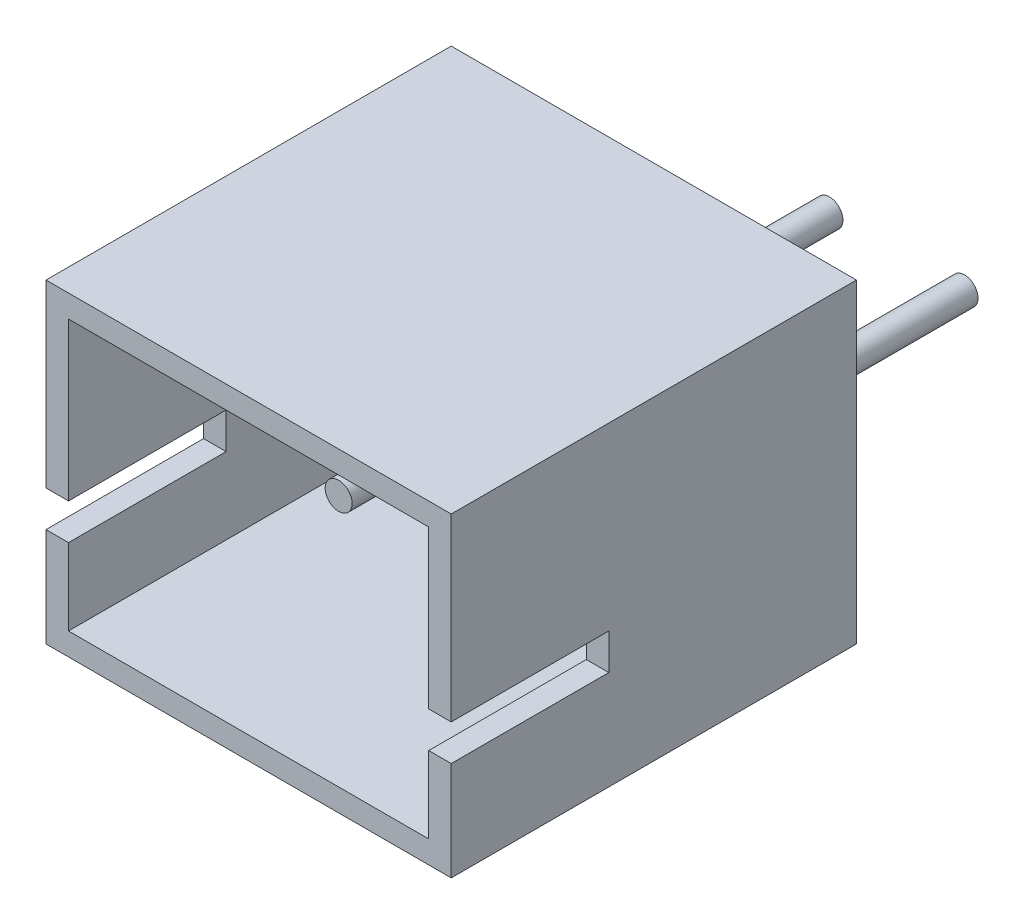
ISO-10303-21;
HEADER;
FILE_DESCRIPTION(('STEP AP214'),'2;1');
FILE_NAME('part.step','',(''),(''),'','','');
FILE_SCHEMA(('AUTOMOTIVE_DESIGN { 1 0 10303 214 1 1 1 1 }'));
ENDSEC;
DATA;
#1=APPLICATION_CONTEXT('core data for automotive mechanical design processes');
#2=APPLICATION_PROTOCOL_DEFINITION('international standard','automotive_design',2000,#1);
#3=PRODUCT_CONTEXT('',#1,'mechanical');
#4=PRODUCT('Part','Part','',(#3));
#5=PRODUCT_RELATED_PRODUCT_CATEGORY('part','',(#4));
#6=PRODUCT_DEFINITION_FORMATION('','',#4);
#7=PRODUCT_DEFINITION_CONTEXT('part definition',#1,'design');
#8=PRODUCT_DEFINITION('design','',#6,#7);
#9=PRODUCT_DEFINITION_SHAPE('','',#8);
#10=(LENGTH_UNIT() NAMED_UNIT(*) SI_UNIT(.MILLI.,.METRE.));
#11=(NAMED_UNIT(*) PLANE_ANGLE_UNIT() SI_UNIT($,.RADIAN.));
#12=(NAMED_UNIT(*) SI_UNIT($,.STERADIAN.) SOLID_ANGLE_UNIT());
#13=UNCERTAINTY_MEASURE_WITH_UNIT(LENGTH_MEASURE(1.E-05),#10,'distance_accuracy_value','');
#14=(GEOMETRIC_REPRESENTATION_CONTEXT(3) GLOBAL_UNCERTAINTY_ASSIGNED_CONTEXT((#13)) GLOBAL_UNIT_ASSIGNED_CONTEXT((#10,
#11,#12)) REPRESENTATION_CONTEXT('',''));
#15=CARTESIAN_POINT('',(0.,0.,0.));
#16=DIRECTION('',(0.,0.,1.));
#17=DIRECTION('',(1.,0.,0.));
#18=AXIS2_PLACEMENT_3D('',#15,#16,#17);
#19=CARTESIAN_POINT('',(0.,0.,4.5));
#20=DIRECTION('',(0.,0.,1.));
#21=DIRECTION('',(1.,0.,0.));
#22=AXIS2_PLACEMENT_3D('',#19,#20,#21);
#23=PLANE('',#22);
#24=DIRECTION('',(-1.,0.,0.));
#25=VECTOR('',#24,1.);
#26=CARTESIAN_POINT('',(0.,-0.25,4.5));
#27=LINE('',#26,#25);
#28=CARTESIAN_POINT('',(2.25,-0.249999999999999,4.5));
#29=VERTEX_POINT('',#28);
#30=CARTESIAN_POINT('',(2.,-0.249999999999999,4.5));
#31=VERTEX_POINT('',#30);
#32=EDGE_CURVE('E214',#29,#31,#27,.T.);
#33=ORIENTED_EDGE('',*,*,#32,.F.);
#34=DIRECTION('',(0.,1.,0.));
#35=VECTOR('',#34,1.);
#36=CARTESIAN_POINT('',(2.25,1.75,4.5));
#37=LINE('',#36,#35);
#38=CARTESIAN_POINT('',(2.25,1.75,4.5));
#39=VERTEX_POINT('',#38);
#40=EDGE_CURVE('E287',#29,#39,#37,.T.);
#41=ORIENTED_EDGE('',*,*,#40,.T.);
#42=DIRECTION('',(-1.,0.,0.));
#43=VECTOR('',#42,1.);
#44=CARTESIAN_POINT('',(-2.25,1.75,4.5));
#45=LINE('',#44,#43);
#46=CARTESIAN_POINT('',(-2.25,1.75,4.5));
#47=VERTEX_POINT('',#46);
#48=EDGE_CURVE('E286',#39,#47,#45,.T.);
#49=ORIENTED_EDGE('',*,*,#48,.T.);
#50=DIRECTION('',(0.,-1.,0.));
#51=VECTOR('',#50,1.);
#52=CARTESIAN_POINT('',(-2.25,1.75,4.5));
#53=LINE('',#52,#51);
#54=CARTESIAN_POINT('',(-2.25,-0.25,4.5));
#55=VERTEX_POINT('',#54);
#56=EDGE_CURVE('E291',#47,#55,#53,.T.);
#57=ORIENTED_EDGE('',*,*,#56,.T.);
#58=CARTESIAN_POINT('',(-2.,-0.25,4.5));
#59=VERTEX_POINT('',#58);
#60=EDGE_CURVE('E210',#59,#55,#27,.T.);
#61=ORIENTED_EDGE('',*,*,#60,.F.);
#62=DIRECTION('',(0.,-1.,0.));
#63=VECTOR('',#62,1.);
#64=CARTESIAN_POINT('',(-2.,1.5,4.5));
#65=LINE('',#64,#63);
#66=CARTESIAN_POINT('',(-2.,1.5,4.5));
#67=VERTEX_POINT('',#66);
#68=EDGE_CURVE('E262',#67,#59,#65,.T.);
#69=ORIENTED_EDGE('',*,*,#68,.F.);
#70=DIRECTION('',(-1.,0.,0.));
#71=VECTOR('',#70,1.);
#72=CARTESIAN_POINT('',(-2.,1.5,4.5));
#73=LINE('',#72,#71);
#74=CARTESIAN_POINT('',(2.,1.5,4.5));
#75=VERTEX_POINT('',#74);
#76=EDGE_CURVE('E257',#75,#67,#73,.T.);
#77=ORIENTED_EDGE('',*,*,#76,.F.);
#78=DIRECTION('',(0.,1.,0.));
#79=VECTOR('',#78,1.);
#80=CARTESIAN_POINT('',(2.,1.5,4.5));
#81=LINE('',#80,#79);
#82=EDGE_CURVE('E234',#31,#75,#81,.T.);
#83=ORIENTED_EDGE('',*,*,#82,.F.);
#84=EDGE_LOOP('',(#33,#41,#49,#57,#61,#69,#77,#83));
#85=FACE_BOUND('',#84,.T.);
#86=ADVANCED_FACE('F39',(#85),#23,.T.);
#87=CARTESIAN_POINT('',(2.25,1.75,4.5));
#88=DIRECTION('',(-1.,0.,0.));
#89=DIRECTION('',(0.,-1.,0.));
#90=AXIS2_PLACEMENT_3D('',#87,#88,#89);
#91=PLANE('',#90);
#92=ORIENTED_EDGE('',*,*,#40,.F.);
#93=DIRECTION('',(0.,0.,-1.));
#94=VECTOR('',#93,1.);
#95=CARTESIAN_POINT('',(2.25,-0.249999999999999,6.25));
#96=LINE('',#95,#94);
#97=CARTESIAN_POINT('',(2.25,-0.25,2.75));
#98=VERTEX_POINT('',#97);
#99=EDGE_CURVE('E173',#29,#98,#96,.T.);
#100=ORIENTED_EDGE('',*,*,#99,.T.);
#101=DIRECTION('',(0.,-1.,0.));
#102=VECTOR('',#101,1.);
#103=CARTESIAN_POINT('',(2.25,-0.25,2.75));
#104=LINE('',#103,#102);
#105=CARTESIAN_POINT('',(2.25,-0.65,2.75));
#106=VERTEX_POINT('',#105);
#107=EDGE_CURVE('E155',#98,#106,#104,.T.);
#108=ORIENTED_EDGE('',*,*,#107,.T.);
#109=DIRECTION('',(0.,0.,1.));
#110=VECTOR('',#109,1.);
#111=CARTESIAN_POINT('',(2.25,-0.649999999999999,6.25));
#112=LINE('',#111,#110);
#113=CARTESIAN_POINT('',(2.25,-0.649999999999999,4.5));
#114=VERTEX_POINT('',#113);
#115=EDGE_CURVE('E165',#106,#114,#112,.T.);
#116=ORIENTED_EDGE('',*,*,#115,.T.);
#117=CARTESIAN_POINT('',(2.25,-1.75,4.5));
#118=VERTEX_POINT('',#117);
#119=EDGE_CURVE('E283',#118,#114,#37,.T.);
#120=ORIENTED_EDGE('',*,*,#119,.F.);
#121=DIRECTION('',(0.,0.,-1.));
#122=VECTOR('',#121,1.);
#123=CARTESIAN_POINT('',(2.25,-1.75,4.5));
#124=LINE('',#123,#122);
#125=CARTESIAN_POINT('',(2.25,-1.75,0.));
#126=VERTEX_POINT('',#125);
#127=EDGE_CURVE('E298',#118,#126,#124,.T.);
#128=ORIENTED_EDGE('',*,*,#127,.T.);
#129=DIRECTION('',(0.,1.,0.));
#130=VECTOR('',#129,1.);
#131=CARTESIAN_POINT('',(2.25,1.75,0.));
#132=LINE('',#131,#130);
#133=CARTESIAN_POINT('',(2.25,1.75,0.));
#134=VERTEX_POINT('',#133);
#135=EDGE_CURVE('E272',#126,#134,#132,.T.);
#136=ORIENTED_EDGE('',*,*,#135,.T.);
#137=DIRECTION('',(0.,0.,-1.));
#138=VECTOR('',#137,1.);
#139=CARTESIAN_POINT('',(2.25,1.75,4.5));
#140=LINE('',#139,#138);
#141=EDGE_CURVE('E322',#39,#134,#140,.T.);
#142=ORIENTED_EDGE('',*,*,#141,.F.);
#143=EDGE_LOOP('',(#92,#100,#108,#116,#120,#128,#136,#142));
#144=FACE_BOUND('',#143,.T.);
#145=ADVANCED_FACE('F41',(#144),#91,.F.);
#146=CARTESIAN_POINT('',(-2.25,1.75,4.5));
#147=DIRECTION('',(0.,-1.,0.));
#148=DIRECTION('',(0.,0.,-1.));
#149=AXIS2_PLACEMENT_3D('',#146,#147,#148);
#150=PLANE('',#149);
#151=DIRECTION('',(-1.,0.,0.));
#152=VECTOR('',#151,1.);
#153=CARTESIAN_POINT('',(-2.25,1.75,0.));
#154=LINE('',#153,#152);
#155=CARTESIAN_POINT('',(-2.25,1.75,0.));
#156=VERTEX_POINT('',#155);
#157=EDGE_CURVE('E302',#134,#156,#154,.T.);
#158=ORIENTED_EDGE('',*,*,#157,.T.);
#159=DIRECTION('',(0.,0.,-1.));
#160=VECTOR('',#159,1.);
#161=CARTESIAN_POINT('',(-2.25,1.75,4.5));
#162=LINE('',#161,#160);
#163=EDGE_CURVE('E318',#47,#156,#162,.T.);
#164=ORIENTED_EDGE('',*,*,#163,.F.);
#165=ORIENTED_EDGE('',*,*,#48,.F.);
#166=ORIENTED_EDGE('',*,*,#141,.T.);
#167=EDGE_LOOP('',(#158,#164,#165,#166));
#168=FACE_BOUND('',#167,.T.);
#169=ADVANCED_FACE('F373',(#168),#150,.F.);
#170=CARTESIAN_POINT('',(-2.25,1.75,4.5));
#171=DIRECTION('',(1.,0.,0.));
#172=DIRECTION('',(0.,1.,0.));
#173=AXIS2_PLACEMENT_3D('',#170,#171,#172);
#174=PLANE('',#173);
#175=DIRECTION('',(0.,-1.,0.));
#176=VECTOR('',#175,1.);
#177=CARTESIAN_POINT('',(-2.25,-0.250000000000001,2.75));
#178=LINE('',#177,#176);
#179=CARTESIAN_POINT('',(-2.25,-0.250000000000001,2.75));
#180=VERTEX_POINT('',#179);
#181=CARTESIAN_POINT('',(-2.25,-0.650000000000001,2.75));
#182=VERTEX_POINT('',#181);
#183=EDGE_CURVE('E185',#180,#182,#178,.T.);
#184=ORIENTED_EDGE('',*,*,#183,.F.);
#185=DIRECTION('',(0.,0.,-1.));
#186=VECTOR('',#185,1.);
#187=CARTESIAN_POINT('',(-2.25,-0.25,6.25));
#188=LINE('',#187,#186);
#189=EDGE_CURVE('E177',#55,#180,#188,.T.);
#190=ORIENTED_EDGE('',*,*,#189,.F.);
#191=ORIENTED_EDGE('',*,*,#56,.F.);
#192=ORIENTED_EDGE('',*,*,#163,.T.);
#193=DIRECTION('',(0.,-1.,0.));
#194=VECTOR('',#193,1.);
#195=CARTESIAN_POINT('',(-2.25,1.75,0.));
#196=LINE('',#195,#194);
#197=CARTESIAN_POINT('',(-2.25,-1.75,0.));
#198=VERTEX_POINT('',#197);
#199=EDGE_CURVE('E305',#156,#198,#196,.T.);
#200=ORIENTED_EDGE('',*,*,#199,.T.);
#201=DIRECTION('',(0.,0.,-1.));
#202=VECTOR('',#201,1.);
#203=CARTESIAN_POINT('',(-2.25,-1.75,4.5));
#204=LINE('',#203,#202);
#205=CARTESIAN_POINT('',(-2.25,-1.75,4.5));
#206=VERTEX_POINT('',#205);
#207=EDGE_CURVE('E314',#206,#198,#204,.T.);
#208=ORIENTED_EDGE('',*,*,#207,.F.);
#209=CARTESIAN_POINT('',(-2.25,-0.65,4.5));
#210=VERTEX_POINT('',#209);
#211=EDGE_CURVE('E290',#210,#206,#53,.T.);
#212=ORIENTED_EDGE('',*,*,#211,.F.);
#213=DIRECTION('',(0.,0.,1.));
#214=VECTOR('',#213,1.);
#215=CARTESIAN_POINT('',(-2.25,-0.65,6.25));
#216=LINE('',#215,#214);
#217=EDGE_CURVE('E180',#182,#210,#216,.T.);
#218=ORIENTED_EDGE('',*,*,#217,.F.);
#219=EDGE_LOOP('',(#184,#190,#191,#192,#200,#208,#212,#218));
#220=FACE_BOUND('',#219,.T.);
#221=ADVANCED_FACE('F361',(#220),#174,.F.);
#222=CARTESIAN_POINT('',(-2.25,-1.75,4.5));
#223=DIRECTION('',(0.,1.,0.));
#224=DIRECTION('',(0.,0.,1.));
#225=AXIS2_PLACEMENT_3D('',#222,#223,#224);
#226=PLANE('',#225);
#227=DIRECTION('',(1.,0.,0.));
#228=VECTOR('',#227,1.);
#229=CARTESIAN_POINT('',(-2.25,-1.75,0.));
#230=LINE('',#229,#228);
#231=EDGE_CURVE('E308',#198,#126,#230,.T.);
#232=ORIENTED_EDGE('',*,*,#231,.T.);
#233=ORIENTED_EDGE('',*,*,#127,.F.);
#234=DIRECTION('',(1.,0.,0.));
#235=VECTOR('',#234,1.);
#236=CARTESIAN_POINT('',(-2.25,-1.75,4.5));
#237=LINE('',#236,#235);
#238=EDGE_CURVE('E295',#206,#118,#237,.T.);
#239=ORIENTED_EDGE('',*,*,#238,.F.);
#240=ORIENTED_EDGE('',*,*,#207,.T.);
#241=EDGE_LOOP('',(#232,#233,#239,#240));
#242=FACE_BOUND('',#241,.T.);
#243=ADVANCED_FACE('F413',(#242),#226,.F.);
#244=DIRECTION('',(1.,0.,0.));
#245=VECTOR('',#244,1.);
#246=CARTESIAN_POINT('',(0.,-0.65,4.5));
#247=LINE('',#246,#245);
#248=CARTESIAN_POINT('',(-2.,-0.65,4.5));
#249=VERTEX_POINT('',#248);
#250=EDGE_CURVE('E63',#210,#249,#247,.T.);
#251=ORIENTED_EDGE('',*,*,#250,.F.);
#252=ORIENTED_EDGE('',*,*,#211,.T.);
#253=ORIENTED_EDGE('',*,*,#238,.T.);
#254=ORIENTED_EDGE('',*,*,#119,.T.);
#255=CARTESIAN_POINT('',(2.,-0.649999999999999,4.5));
#256=VERTEX_POINT('',#255);
#257=EDGE_CURVE('E168',#256,#114,#247,.T.);
#258=ORIENTED_EDGE('',*,*,#257,.F.);
#259=CARTESIAN_POINT('',(2.,-1.5,4.5));
#260=VERTEX_POINT('',#259);
#261=EDGE_CURVE('E253',#260,#256,#81,.T.);
#262=ORIENTED_EDGE('',*,*,#261,.F.);
#263=DIRECTION('',(1.,0.,0.));
#264=VECTOR('',#263,1.);
#265=CARTESIAN_POINT('',(-2.,-1.5,4.5));
#266=LINE('',#265,#264);
#267=CARTESIAN_POINT('',(-2.,-1.5,4.5));
#268=VERTEX_POINT('',#267);
#269=EDGE_CURVE('E240',#268,#260,#266,.T.);
#270=ORIENTED_EDGE('',*,*,#269,.F.);
#271=EDGE_CURVE('E261',#249,#268,#65,.T.);
#272=ORIENTED_EDGE('',*,*,#271,.F.);
#273=EDGE_LOOP('',(#251,#252,#253,#254,#258,#262,#270,#272));
#274=FACE_BOUND('',#273,.T.);
#275=ADVANCED_FACE('F343',(#274),#23,.T.);
#276=CARTESIAN_POINT('',(0.,0.,0.));
#277=DIRECTION('',(0.,0.,1.));
#278=DIRECTION('',(1.,0.,0.));
#279=AXIS2_PLACEMENT_3D('',#276,#277,#278);
#280=PLANE('',#279);
#281=CARTESIAN_POINT('',(-0.75,-0.45,0.));
#282=DIRECTION('',(0.,0.,1.));
#283=DIRECTION('',(1.,0.,0.));
#284=AXIS2_PLACEMENT_3D('',#281,#282,#283);
#285=CIRCLE('',#284,0.15);
#286=CARTESIAN_POINT('',(-0.6,-0.45,0.));
#287=VERTEX_POINT('',#286);
#288=EDGE_CURVE('E222',#287,#287,#285,.T.);
#289=ORIENTED_EDGE('',*,*,#288,.T.);
#290=EDGE_LOOP('',(#289));
#291=FACE_BOUND('',#290,.T.);
#292=CARTESIAN_POINT('',(0.75,-0.45,0.));
#293=DIRECTION('',(0.,0.,1.));
#294=DIRECTION('',(1.,0.,0.));
#295=AXIS2_PLACEMENT_3D('',#292,#293,#294);
#296=CIRCLE('',#295,0.15);
#297=CARTESIAN_POINT('',(0.9,-0.45,0.));
#298=VERTEX_POINT('',#297);
#299=EDGE_CURVE('E230',#298,#298,#296,.T.);
#300=ORIENTED_EDGE('',*,*,#299,.T.);
#301=EDGE_LOOP('',(#300));
#302=FACE_BOUND('',#301,.T.);
#303=ORIENTED_EDGE('',*,*,#135,.F.);
#304=ORIENTED_EDGE('',*,*,#231,.F.);
#305=ORIENTED_EDGE('',*,*,#199,.F.);
#306=ORIENTED_EDGE('',*,*,#157,.F.);
#307=EDGE_LOOP('',(#303,#304,#305,#306));
#308=FACE_BOUND('',#307,.T.);
#309=ADVANCED_FACE('F379',(#291,#302,#308),#280,.F.);
#310=CARTESIAN_POINT('',(2.,1.5,0.249999999999999));
#311=DIRECTION('',(1.,0.,0.));
#312=DIRECTION('',(0.,1.,0.));
#313=AXIS2_PLACEMENT_3D('',#310,#311,#312);
#314=PLANE('',#313);
#315=DIRECTION('',(0.,1.,0.));
#316=VECTOR('',#315,1.);
#317=CARTESIAN_POINT('',(2.,1.5,2.75));
#318=LINE('',#317,#316);
#319=CARTESIAN_POINT('',(2.,-0.65,2.75));
#320=VERTEX_POINT('',#319);
#321=CARTESIAN_POINT('',(2.,-0.25,2.75));
#322=VERTEX_POINT('',#321);
#323=EDGE_CURVE('E158',#320,#322,#318,.T.);
#324=ORIENTED_EDGE('',*,*,#323,.T.);
#325=DIRECTION('',(0.,0.,1.));
#326=VECTOR('',#325,1.);
#327=CARTESIAN_POINT('',(2.,-0.25,0.25));
#328=LINE('',#327,#326);
#329=EDGE_CURVE('E213',#322,#31,#328,.T.);
#330=ORIENTED_EDGE('',*,*,#329,.T.);
#331=ORIENTED_EDGE('',*,*,#82,.T.);
#332=DIRECTION('',(0.,0.,1.));
#333=VECTOR('',#332,1.);
#334=CARTESIAN_POINT('',(2.,1.5,0.249999999999999));
#335=LINE('',#334,#333);
#336=CARTESIAN_POINT('',(2.,1.5,0.249999999999999));
#337=VERTEX_POINT('',#336);
#338=EDGE_CURVE('E252',#337,#75,#335,.T.);
#339=ORIENTED_EDGE('',*,*,#338,.F.);
#340=DIRECTION('',(0.,1.,0.));
#341=VECTOR('',#340,1.);
#342=CARTESIAN_POINT('',(2.,1.5,0.249999999999999));
#343=LINE('',#342,#341);
#344=CARTESIAN_POINT('',(2.,-1.5,0.249999999999999));
#345=VERTEX_POINT('',#344);
#346=EDGE_CURVE('E235',#345,#337,#343,.T.);
#347=ORIENTED_EDGE('',*,*,#346,.F.);
#348=DIRECTION('',(0.,0.,1.));
#349=VECTOR('',#348,1.);
#350=CARTESIAN_POINT('',(2.,-1.5,0.249999999999999));
#351=LINE('',#350,#349);
#352=EDGE_CURVE('E269',#345,#260,#351,.T.);
#353=ORIENTED_EDGE('',*,*,#352,.T.);
#354=ORIENTED_EDGE('',*,*,#261,.T.);
#355=DIRECTION('',(0.,0.,-1.));
#356=VECTOR('',#355,1.);
#357=CARTESIAN_POINT('',(2.,-0.65,0.25));
#358=LINE('',#357,#356);
#359=EDGE_CURVE('E207',#256,#320,#358,.T.);
#360=ORIENTED_EDGE('',*,*,#359,.T.);
#361=EDGE_LOOP('',(#324,#330,#331,#339,#347,#353,#354,#360));
#362=FACE_BOUND('',#361,.T.);
#363=ADVANCED_FACE('F390',(#362),#314,.F.);
#364=CARTESIAN_POINT('',(-2.,-1.5,0.249999999999999));
#365=DIRECTION('',(0.,-1.,0.));
#366=DIRECTION('',(0.,0.,-1.));
#367=AXIS2_PLACEMENT_3D('',#364,#365,#366);
#368=PLANE('',#367);
#369=ORIENTED_EDGE('',*,*,#269,.T.);
#370=ORIENTED_EDGE('',*,*,#352,.F.);
#371=DIRECTION('',(1.,0.,0.));
#372=VECTOR('',#371,1.);
#373=CARTESIAN_POINT('',(-2.,-1.5,0.249999999999999));
#374=LINE('',#373,#372);
#375=CARTESIAN_POINT('',(-2.,-1.5,0.249999999999999));
#376=VERTEX_POINT('',#375);
#377=EDGE_CURVE('E248',#376,#345,#374,.T.);
#378=ORIENTED_EDGE('',*,*,#377,.F.);
#379=DIRECTION('',(0.,0.,1.));
#380=VECTOR('',#379,1.);
#381=CARTESIAN_POINT('',(-2.,-1.5,0.249999999999999));
#382=LINE('',#381,#380);
#383=EDGE_CURVE('E273',#376,#268,#382,.T.);
#384=ORIENTED_EDGE('',*,*,#383,.T.);
#385=EDGE_LOOP('',(#369,#370,#378,#384));
#386=FACE_BOUND('',#385,.T.);
#387=ADVANCED_FACE('F451',(#386),#368,.F.);
#388=CARTESIAN_POINT('',(-2.,1.5,0.249999999999999));
#389=DIRECTION('',(-1.,0.,0.));
#390=DIRECTION('',(0.,0.,1.));
#391=AXIS2_PLACEMENT_3D('',#388,#389,#390);
#392=PLANE('',#391);
#393=ORIENTED_EDGE('',*,*,#68,.T.);
#394=DIRECTION('',(0.,0.,-1.));
#395=VECTOR('',#394,1.);
#396=CARTESIAN_POINT('',(-2.,-0.250000000000001,0.25));
#397=LINE('',#396,#395);
#398=CARTESIAN_POINT('',(-2.,-0.250000000000001,2.75));
#399=VERTEX_POINT('',#398);
#400=EDGE_CURVE('E11',#59,#399,#397,.T.);
#401=ORIENTED_EDGE('',*,*,#400,.T.);
#402=DIRECTION('',(0.,-1.,0.));
#403=VECTOR('',#402,1.);
#404=CARTESIAN_POINT('',(-2.,1.5,2.75));
#405=LINE('',#404,#403);
#406=CARTESIAN_POINT('',(-2.,-0.650000000000001,2.75));
#407=VERTEX_POINT('',#406);
#408=EDGE_CURVE('E199',#399,#407,#405,.T.);
#409=ORIENTED_EDGE('',*,*,#408,.T.);
#410=DIRECTION('',(0.,0.,1.));
#411=VECTOR('',#410,1.);
#412=CARTESIAN_POINT('',(-2.,-0.650000000000001,0.25));
#413=LINE('',#412,#411);
#414=EDGE_CURVE('E48',#407,#249,#413,.T.);
#415=ORIENTED_EDGE('',*,*,#414,.T.);
#416=ORIENTED_EDGE('',*,*,#271,.T.);
#417=ORIENTED_EDGE('',*,*,#383,.F.);
#418=DIRECTION('',(0.,-1.,0.));
#419=VECTOR('',#418,1.);
#420=CARTESIAN_POINT('',(-2.,1.5,0.249999999999999));
#421=LINE('',#420,#419);
#422=CARTESIAN_POINT('',(-2.,1.5,0.249999999999999));
#423=VERTEX_POINT('',#422);
#424=EDGE_CURVE('E244',#423,#376,#421,.T.);
#425=ORIENTED_EDGE('',*,*,#424,.F.);
#426=DIRECTION('',(0.,0.,1.));
#427=VECTOR('',#426,1.);
#428=CARTESIAN_POINT('',(-2.,1.5,0.249999999999999));
#429=LINE('',#428,#427);
#430=EDGE_CURVE('E277',#423,#67,#429,.T.);
#431=ORIENTED_EDGE('',*,*,#430,.T.);
#432=EDGE_LOOP('',(#393,#401,#409,#415,#416,#417,#425,#431));
#433=FACE_BOUND('',#432,.T.);
#434=ADVANCED_FACE('F339',(#433),#392,.F.);
#435=CARTESIAN_POINT('',(-2.,1.5,0.249999999999999));
#436=DIRECTION('',(0.,1.,0.));
#437=DIRECTION('',(0.,0.,1.));
#438=AXIS2_PLACEMENT_3D('',#435,#436,#437);
#439=PLANE('',#438);
#440=ORIENTED_EDGE('',*,*,#76,.T.);
#441=ORIENTED_EDGE('',*,*,#430,.F.);
#442=DIRECTION('',(-1.,0.,0.));
#443=VECTOR('',#442,1.);
#444=CARTESIAN_POINT('',(-2.,1.5,0.249999999999999));
#445=LINE('',#444,#443);
#446=EDGE_CURVE('E239',#337,#423,#445,.T.);
#447=ORIENTED_EDGE('',*,*,#446,.F.);
#448=ORIENTED_EDGE('',*,*,#338,.T.);
#449=EDGE_LOOP('',(#440,#441,#447,#448));
#450=FACE_BOUND('',#449,.T.);
#451=ADVANCED_FACE('F388',(#450),#439,.F.);
#452=CARTESIAN_POINT('',(0.,0.,0.249999999999999));
#453=DIRECTION('',(0.,0.,1.));
#454=DIRECTION('',(1.,0.,0.));
#455=AXIS2_PLACEMENT_3D('',#452,#453,#454);
#456=PLANE('',#455);
#457=CARTESIAN_POINT('',(-0.75,-0.45,0.249999999999999));
#458=DIRECTION('',(0.,0.,1.));
#459=DIRECTION('',(1.,0.,0.));
#460=AXIS2_PLACEMENT_3D('',#457,#458,#459);
#461=CIRCLE('',#460,0.15);
#462=CARTESIAN_POINT('',(-0.6,-0.45,0.249999999999999));
#463=VERTEX_POINT('',#462);
#464=EDGE_CURVE('E330',#463,#463,#461,.T.);
#465=ORIENTED_EDGE('',*,*,#464,.F.);
#466=EDGE_LOOP('',(#465));
#467=FACE_BOUND('',#466,.T.);
#468=CARTESIAN_POINT('',(0.75,-0.45,0.249999999999999));
#469=DIRECTION('',(0.,0.,1.));
#470=DIRECTION('',(1.,0.,0.));
#471=AXIS2_PLACEMENT_3D('',#468,#469,#470);
#472=CIRCLE('',#471,0.15);
#473=CARTESIAN_POINT('',(0.9,-0.45,0.249999999999999));
#474=VERTEX_POINT('',#473);
#475=EDGE_CURVE('E326',#474,#474,#472,.T.);
#476=ORIENTED_EDGE('',*,*,#475,.F.);
#477=EDGE_LOOP('',(#476));
#478=FACE_BOUND('',#477,.T.);
#479=ORIENTED_EDGE('',*,*,#346,.T.);
#480=ORIENTED_EDGE('',*,*,#446,.T.);
#481=ORIENTED_EDGE('',*,*,#424,.T.);
#482=ORIENTED_EDGE('',*,*,#377,.T.);
#483=EDGE_LOOP('',(#479,#480,#481,#482));
#484=FACE_BOUND('',#483,.T.);
#485=ADVANCED_FACE('F473',(#467,#478,#484),#456,.T.);
#486=CARTESIAN_POINT('',(0.75,-0.45,4.));
#487=DIRECTION('',(0.,0.,-1.));
#488=DIRECTION('',(-1.,0.,0.));
#489=AXIS2_PLACEMENT_3D('',#486,#487,#488);
#490=CYLINDRICAL_SURFACE('',#489,0.15);
#491=CARTESIAN_POINT('',(0.75,-0.45,2.75));
#492=DIRECTION('',(0.,0.,-1.));
#493=DIRECTION('',(-1.,0.,0.));
#494=AXIS2_PLACEMENT_3D('',#491,#492,#493);
#495=CIRCLE('',#494,0.15);
#496=CARTESIAN_POINT('',(0.6,-0.45,2.75));
#497=VERTEX_POINT('',#496);
#498=EDGE_CURVE('E195',#497,#497,#495,.F.);
#499=ORIENTED_EDGE('',*,*,#498,.F.);
#500=EDGE_LOOP('',(#499));
#501=FACE_BOUND('',#500,.T.);
#502=ORIENTED_EDGE('',*,*,#475,.T.);
#503=EDGE_LOOP('',(#502));
#504=FACE_BOUND('',#503,.T.);
#505=ADVANCED_FACE('F467',(#501,#504),#490,.T.);
#506=CARTESIAN_POINT('',(0.75,-0.45,-2.7));
#507=DIRECTION('',(0.,0.,-1.));
#508=DIRECTION('',(-1.,0.,0.));
#509=AXIS2_PLACEMENT_3D('',#506,#507,#508);
#510=CIRCLE('',#509,0.15);
#511=CARTESIAN_POINT('',(0.6,-0.45,-2.7));
#512=VERTEX_POINT('',#511);
#513=EDGE_CURVE('E226',#512,#512,#510,.T.);
#514=ORIENTED_EDGE('',*,*,#513,.F.);
#515=EDGE_LOOP('',(#514));
#516=FACE_BOUND('',#515,.T.);
#517=ORIENTED_EDGE('',*,*,#299,.F.);
#518=EDGE_LOOP('',(#517));
#519=FACE_BOUND('',#518,.T.);
#520=ADVANCED_FACE('F472',(#516,#519),#490,.T.);
#521=CARTESIAN_POINT('',(0.75,-0.45,-2.7));
#522=DIRECTION('',(0.,0.,-1.));
#523=DIRECTION('',(-1.,0.,0.));
#524=AXIS2_PLACEMENT_3D('',#521,#522,#523);
#525=PLANE('',#524);
#526=ORIENTED_EDGE('',*,*,#513,.T.);
#527=EDGE_LOOP('',(#526));
#528=FACE_BOUND('',#527,.T.);
#529=ADVANCED_FACE('F489',(#528),#525,.T.);
#530=CARTESIAN_POINT('',(-0.75,-0.45,4.));
#531=DIRECTION('',(0.,0.,-1.));
#532=DIRECTION('',(-1.,0.,0.));
#533=AXIS2_PLACEMENT_3D('',#530,#531,#532);
#534=CYLINDRICAL_SURFACE('',#533,0.15);
#535=CARTESIAN_POINT('',(-0.75,-0.45,2.75));
#536=DIRECTION('',(0.,0.,-1.));
#537=DIRECTION('',(-1.,0.,0.));
#538=AXIS2_PLACEMENT_3D('',#535,#536,#537);
#539=CIRCLE('',#538,0.15);
#540=CARTESIAN_POINT('',(-0.9,-0.45,2.75));
#541=VERTEX_POINT('',#540);
#542=EDGE_CURVE('E193',#541,#541,#539,.F.);
#543=ORIENTED_EDGE('',*,*,#542,.F.);
#544=EDGE_LOOP('',(#543));
#545=FACE_BOUND('',#544,.T.);
#546=ORIENTED_EDGE('',*,*,#464,.T.);
#547=EDGE_LOOP('',(#546));
#548=FACE_BOUND('',#547,.T.);
#549=ADVANCED_FACE('F483',(#545,#548),#534,.T.);
#550=CARTESIAN_POINT('',(-0.75,-0.45,-2.7));
#551=DIRECTION('',(0.,0.,-1.));
#552=DIRECTION('',(1.,0.,0.));
#553=AXIS2_PLACEMENT_3D('',#550,#551,#552);
#554=CIRCLE('',#553,0.15);
#555=CARTESIAN_POINT('',(-0.6,-0.45,-2.7));
#556=VERTEX_POINT('',#555);
#557=EDGE_CURVE('E218',#556,#556,#554,.T.);
#558=ORIENTED_EDGE('',*,*,#557,.F.);
#559=EDGE_LOOP('',(#558));
#560=FACE_BOUND('',#559,.T.);
#561=ORIENTED_EDGE('',*,*,#288,.F.);
#562=EDGE_LOOP('',(#561));
#563=FACE_BOUND('',#562,.T.);
#564=ADVANCED_FACE('F488',(#560,#563),#534,.T.);
#565=CARTESIAN_POINT('',(-0.75,-0.45,-2.7));
#566=DIRECTION('',(0.,0.,1.));
#567=DIRECTION('',(1.,0.,0.));
#568=AXIS2_PLACEMENT_3D('',#565,#566,#567);
#569=PLANE('',#568);
#570=ORIENTED_EDGE('',*,*,#557,.T.);
#571=EDGE_LOOP('',(#570));
#572=FACE_BOUND('',#571,.T.);
#573=ADVANCED_FACE('F504',(#572),#569,.F.);
#574=CARTESIAN_POINT('',(2.25,-0.25,2.75));
#575=DIRECTION('',(0.,0.,-1.));
#576=DIRECTION('',(-1.,0.,0.));
#577=AXIS2_PLACEMENT_3D('',#574,#575,#576);
#578=PLANE('',#577);
#579=ORIENTED_EDGE('',*,*,#542,.T.);
#580=EDGE_LOOP('',(#579));
#581=FACE_BOUND('',#580,.T.);
#582=ADVANCED_FACE('F499',(#581),#578,.F.);
#583=ORIENTED_EDGE('',*,*,#498,.T.);
#584=EDGE_LOOP('',(#583));
#585=FACE_BOUND('',#584,.T.);
#586=ADVANCED_FACE('F403',(#585),#578,.F.);
#587=CARTESIAN_POINT('',(2.25,-0.649999999999999,6.25));
#588=DIRECTION('',(0.,-1.,0.));
#589=DIRECTION('',(1.,0.,0.));
#590=AXIS2_PLACEMENT_3D('',#587,#588,#589);
#591=PLANE('',#590);
#592=ORIENTED_EDGE('',*,*,#250,.T.);
#593=ORIENTED_EDGE('',*,*,#414,.F.);
#594=DIRECTION('',(-1.,0.,0.));
#595=VECTOR('',#594,1.);
#596=CARTESIAN_POINT('',(2.25,-0.65,2.75));
#597=LINE('',#596,#595);
#598=EDGE_CURVE('E162',#407,#182,#597,.T.);
#599=ORIENTED_EDGE('',*,*,#598,.T.);
#600=ORIENTED_EDGE('',*,*,#217,.T.);
#601=EDGE_LOOP('',(#592,#593,#599,#600));
#602=FACE_BOUND('',#601,.T.);
#603=ADVANCED_FACE('F353',(#602),#591,.F.);
#604=CARTESIAN_POINT('',(2.25,-0.249999999999999,6.25));
#605=DIRECTION('',(0.,1.,0.));
#606=DIRECTION('',(-1.,0.,0.));
#607=AXIS2_PLACEMENT_3D('',#604,#605,#606);
#608=PLANE('',#607);
#609=ORIENTED_EDGE('',*,*,#60,.T.);
#610=ORIENTED_EDGE('',*,*,#189,.T.);
#611=DIRECTION('',(-1.,0.,0.));
#612=VECTOR('',#611,1.);
#613=CARTESIAN_POINT('',(2.25,-0.25,2.75));
#614=LINE('',#613,#612);
#615=EDGE_CURVE('E161',#399,#180,#614,.T.);
#616=ORIENTED_EDGE('',*,*,#615,.F.);
#617=ORIENTED_EDGE('',*,*,#400,.F.);
#618=EDGE_LOOP('',(#609,#610,#616,#617));
#619=FACE_BOUND('',#618,.T.);
#620=ADVANCED_FACE('F396',(#619),#608,.F.);
#621=ORIENTED_EDGE('',*,*,#615,.T.);
#622=ORIENTED_EDGE('',*,*,#183,.T.);
#623=ORIENTED_EDGE('',*,*,#598,.F.);
#624=ORIENTED_EDGE('',*,*,#408,.F.);
#625=EDGE_LOOP('',(#621,#622,#623,#624));
#626=FACE_BOUND('',#625,.T.);
#627=ADVANCED_FACE('F357',(#626),#578,.F.);
#628=ORIENTED_EDGE('',*,*,#32,.T.);
#629=ORIENTED_EDGE('',*,*,#329,.F.);
#630=EDGE_CURVE('E191',#98,#322,#614,.T.);
#631=ORIENTED_EDGE('',*,*,#630,.F.);
#632=ORIENTED_EDGE('',*,*,#99,.F.);
#633=EDGE_LOOP('',(#628,#629,#631,#632));
#634=FACE_BOUND('',#633,.T.);
#635=ADVANCED_FACE('F393',(#634),#608,.F.);
#636=ORIENTED_EDGE('',*,*,#257,.T.);
#637=ORIENTED_EDGE('',*,*,#115,.F.);
#638=EDGE_CURVE('E55',#106,#320,#597,.T.);
#639=ORIENTED_EDGE('',*,*,#638,.T.);
#640=ORIENTED_EDGE('',*,*,#359,.F.);
#641=EDGE_LOOP('',(#636,#637,#639,#640));
#642=FACE_BOUND('',#641,.T.);
#643=ADVANCED_FACE('F166',(#642),#591,.F.);
#644=ORIENTED_EDGE('',*,*,#638,.F.);
#645=ORIENTED_EDGE('',*,*,#107,.F.);
#646=ORIENTED_EDGE('',*,*,#630,.T.);
#647=ORIENTED_EDGE('',*,*,#323,.F.);
#648=EDGE_LOOP('',(#644,#645,#646,#647));
#649=FACE_BOUND('',#648,.T.);
#650=ADVANCED_FACE('F152',(#649),#578,.F.);
#651=CLOSED_SHELL('',(#86,#145,#169,#221,#243,#275,#309,#363,#387,#434,#451,#485,#505,#520,#529,
#549,#564,#573,#582,#586,#603,#620,#627,#635,#643,#650));
#652=MANIFOLD_SOLID_BREP('B2',#651);
#653=ADVANCED_BREP_SHAPE_REPRESENTATION('',(#18,#652),#14);
#654=SHAPE_DEFINITION_REPRESENTATION(#9,#653);
ENDSEC;
END-ISO-10303-21;
